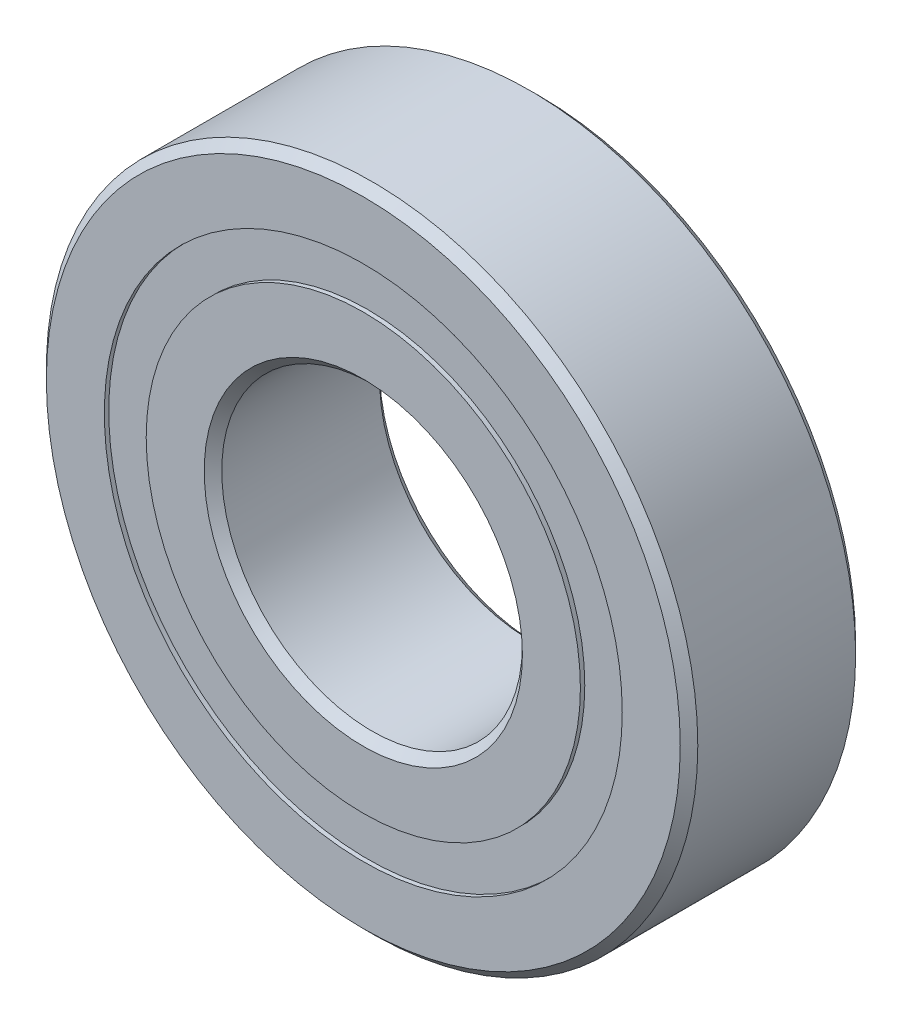
ISO-10303-21;
HEADER;
FILE_DESCRIPTION(('STEP AP214'),'2;1');
FILE_NAME('part.step','',(''),(''),'','','');
FILE_SCHEMA(('AUTOMOTIVE_DESIGN { 1 0 10303 214 1 1 1 1 }'));
ENDSEC;
DATA;
#1=APPLICATION_CONTEXT('core data for automotive mechanical design processes');
#2=APPLICATION_PROTOCOL_DEFINITION('international standard','automotive_design',2000,#1);
#3=PRODUCT_CONTEXT('',#1,'mechanical');
#4=PRODUCT('Part','Part','',(#3));
#5=PRODUCT_RELATED_PRODUCT_CATEGORY('part','',(#4));
#6=PRODUCT_DEFINITION_FORMATION('','',#4);
#7=PRODUCT_DEFINITION_CONTEXT('part definition',#1,'design');
#8=PRODUCT_DEFINITION('design','',#6,#7);
#9=PRODUCT_DEFINITION_SHAPE('','',#8);
#10=(LENGTH_UNIT() NAMED_UNIT(*) SI_UNIT(.MILLI.,.METRE.));
#11=(NAMED_UNIT(*) PLANE_ANGLE_UNIT() SI_UNIT($,.RADIAN.));
#12=(NAMED_UNIT(*) SI_UNIT($,.STERADIAN.) SOLID_ANGLE_UNIT());
#13=UNCERTAINTY_MEASURE_WITH_UNIT(LENGTH_MEASURE(1.E-05),#10,'distance_accuracy_value','');
#14=(GEOMETRIC_REPRESENTATION_CONTEXT(3) GLOBAL_UNCERTAINTY_ASSIGNED_CONTEXT((#13)) GLOBAL_UNIT_ASSIGNED_CONTEXT((#10,
#11,#12)) REPRESENTATION_CONTEXT('',''));
#15=CARTESIAN_POINT('',(0.,0.,0.));
#16=DIRECTION('',(0.,0.,1.));
#17=DIRECTION('',(1.,0.,0.));
#18=AXIS2_PLACEMENT_3D('',#15,#16,#17);
#19=CARTESIAN_POINT('',(0.,16.4070741758242,-5.2784375));
#20=DIRECTION('',(0.,0.,1.));
#21=DIRECTION('',(1.,0.,0.));
#22=AXIS2_PLACEMENT_3D('',#19,#20,#21);
#23=PLANE('',#22);
#24=CARTESIAN_POINT('',(0.,0.,-5.2784375));
#25=DIRECTION('',(0.,0.,1.));
#26=DIRECTION('',(1.,0.,0.));
#27=AXIS2_PLACEMENT_3D('',#24,#25,#26);
#28=CIRCLE('',#27,16.4070741758242);
#29=CARTESIAN_POINT('',(16.4070741758242,0.,-5.2784375));
#30=VERTEX_POINT('',#29);
#31=EDGE_CURVE('E57',#30,#30,#28,.T.);
#32=ORIENTED_EDGE('',*,*,#31,.F.);
#33=EDGE_LOOP('',(#32));
#34=FACE_BOUND('',#33,.T.);
#35=CARTESIAN_POINT('',(0.,0.,-5.2784375));
#36=DIRECTION('',(0.,0.,1.));
#37=DIRECTION('',(1.,0.,0.));
#38=AXIS2_PLACEMENT_3D('',#35,#36,#37);
#39=CIRCLE('',#38,13.7554258241758);
#40=CARTESIAN_POINT('',(13.7554258241758,0.,-5.2784375));
#41=VERTEX_POINT('',#40);
#42=EDGE_CURVE('E11',#41,#41,#39,.T.);
#43=ORIENTED_EDGE('',*,*,#42,.T.);
#44=EDGE_LOOP('',(#43));
#45=FACE_BOUND('',#44,.T.);
#46=ADVANCED_FACE('F43',(#34,#45),#23,.F.);
#47=CARTESIAN_POINT('',(0.,0.,5.55625));
#48=DIRECTION('',(0.,0.,1.));
#49=DIRECTION('',(1.,0.,0.));
#50=AXIS2_PLACEMENT_3D('',#47,#48,#49);
#51=CYLINDRICAL_SURFACE('',#50,13.7554258241758);
#52=ORIENTED_EDGE('',*,*,#42,.F.);
#53=EDGE_LOOP('',(#52));
#54=FACE_BOUND('',#53,.T.);
#55=CARTESIAN_POINT('',(0.,0.,-2.80284955168796));
#56=DIRECTION('',(0.,0.,1.));
#57=DIRECTION('',(1.,0.,0.));
#58=AXIS2_PLACEMENT_3D('',#55,#56,#57);
#59=CIRCLE('',#58,13.7554258241758);
#60=CARTESIAN_POINT('',(13.7554258241758,0.,-2.80284955168796));
#61=VERTEX_POINT('',#60);
#62=EDGE_CURVE('E49',#61,#61,#59,.T.);
#63=ORIENTED_EDGE('',*,*,#62,.T.);
#64=EDGE_LOOP('',(#63));
#65=FACE_BOUND('',#64,.T.);
#66=ADVANCED_FACE('F66',(#54,#65),#51,.F.);
#67=CARTESIAN_POINT('',(0.,16.4070741758242,-2.80284955168796));
#68=DIRECTION('',(0.,0.,-1.));
#69=DIRECTION('',(-1.,0.,0.));
#70=AXIS2_PLACEMENT_3D('',#67,#68,#69);
#71=PLANE('',#70);
#72=ORIENTED_EDGE('',*,*,#62,.F.);
#73=EDGE_LOOP('',(#72));
#74=FACE_BOUND('',#73,.T.);
#75=CARTESIAN_POINT('',(0.,0.,-2.80284955168796));
#76=DIRECTION('',(0.,0.,1.));
#77=DIRECTION('',(1.,0.,0.));
#78=AXIS2_PLACEMENT_3D('',#75,#76,#77);
#79=CIRCLE('',#78,16.4070741758242);
#80=CARTESIAN_POINT('',(16.4070741758242,0.,-2.80284955168796));
#81=VERTEX_POINT('',#80);
#82=EDGE_CURVE('E53',#81,#81,#79,.T.);
#83=ORIENTED_EDGE('',*,*,#82,.T.);
#84=EDGE_LOOP('',(#83));
#85=FACE_BOUND('',#84,.T.);
#86=ADVANCED_FACE('F70',(#74,#85),#71,.F.);
#87=CARTESIAN_POINT('',(0.,0.,5.55625));
#88=DIRECTION('',(0.,0.,1.));
#89=DIRECTION('',(1.,0.,0.));
#90=AXIS2_PLACEMENT_3D('',#87,#88,#89);
#91=CYLINDRICAL_SURFACE('',#90,16.4070741758242);
#92=ORIENTED_EDGE('',*,*,#82,.F.);
#93=EDGE_LOOP('',(#92));
#94=FACE_BOUND('',#93,.T.);
#95=ORIENTED_EDGE('',*,*,#31,.T.);
#96=EDGE_LOOP('',(#95));
#97=FACE_BOUND('',#96,.T.);
#98=ADVANCED_FACE('F63',(#94,#97),#91,.T.);
#99=CLOSED_SHELL('',(#46,#66,#86,#98));
#100=MANIFOLD_SOLID_BREP('B2',#99);
#101=CARTESIAN_POINT('',(0.,16.4070741758242,5.2784375));
#102=DIRECTION('',(0.,0.,-1.));
#103=DIRECTION('',(-1.,0.,0.));
#104=AXIS2_PLACEMENT_3D('',#101,#102,#103);
#105=PLANE('',#104);
#106=CARTESIAN_POINT('',(0.,0.,5.2784375));
#107=DIRECTION('',(0.,0.,1.));
#108=DIRECTION('',(1.,0.,0.));
#109=AXIS2_PLACEMENT_3D('',#106,#107,#108);
#110=CIRCLE('',#109,13.7554258241758);
#111=CARTESIAN_POINT('',(13.7554258241758,0.,5.2784375));
#112=VERTEX_POINT('',#111);
#113=EDGE_CURVE('E42',#112,#112,#110,.T.);
#114=ORIENTED_EDGE('',*,*,#113,.F.);
#115=EDGE_LOOP('',(#114));
#116=FACE_BOUND('',#115,.T.);
#117=CARTESIAN_POINT('',(0.,0.,5.2784375));
#118=DIRECTION('',(0.,0.,1.));
#119=DIRECTION('',(1.,0.,0.));
#120=AXIS2_PLACEMENT_3D('',#117,#118,#119);
#121=CIRCLE('',#120,16.4070741758242);
#122=CARTESIAN_POINT('',(16.4070741758242,0.,5.2784375));
#123=VERTEX_POINT('',#122);
#124=EDGE_CURVE('E124',#123,#123,#121,.T.);
#125=ORIENTED_EDGE('',*,*,#124,.T.);
#126=EDGE_LOOP('',(#125));
#127=FACE_BOUND('',#126,.T.);
#128=ADVANCED_FACE('F110',(#116,#127),#105,.F.);
#129=CARTESIAN_POINT('',(0.,0.,5.55625));
#130=DIRECTION('',(0.,0.,1.));
#131=DIRECTION('',(1.,0.,0.));
#132=AXIS2_PLACEMENT_3D('',#129,#130,#131);
#133=CYLINDRICAL_SURFACE('',#132,13.7554258241758);
#134=CARTESIAN_POINT('',(0.,0.,2.80284955168796));
#135=DIRECTION('',(0.,0.,1.));
#136=DIRECTION('',(1.,0.,0.));
#137=AXIS2_PLACEMENT_3D('',#134,#135,#136);
#138=CIRCLE('',#137,13.7554258241758);
#139=CARTESIAN_POINT('',(13.7554258241758,0.,2.80284955168796));
#140=VERTEX_POINT('',#139);
#141=EDGE_CURVE('E116',#140,#140,#138,.T.);
#142=ORIENTED_EDGE('',*,*,#141,.F.);
#143=EDGE_LOOP('',(#142));
#144=FACE_BOUND('',#143,.T.);
#145=ORIENTED_EDGE('',*,*,#113,.T.);
#146=EDGE_LOOP('',(#145));
#147=FACE_BOUND('',#146,.T.);
#148=ADVANCED_FACE('F139',(#144,#147),#133,.F.);
#149=CARTESIAN_POINT('',(0.,16.4070741758242,2.80284955168796));
#150=DIRECTION('',(0.,0.,1.));
#151=DIRECTION('',(1.,0.,0.));
#152=AXIS2_PLACEMENT_3D('',#149,#150,#151);
#153=PLANE('',#152);
#154=CARTESIAN_POINT('',(0.,0.,2.80284955168796));
#155=DIRECTION('',(0.,0.,1.));
#156=DIRECTION('',(1.,0.,0.));
#157=AXIS2_PLACEMENT_3D('',#154,#155,#156);
#158=CIRCLE('',#157,16.4070741758242);
#159=CARTESIAN_POINT('',(16.4070741758242,0.,2.80284955168796));
#160=VERTEX_POINT('',#159);
#161=EDGE_CURVE('E120',#160,#160,#158,.T.);
#162=ORIENTED_EDGE('',*,*,#161,.F.);
#163=EDGE_LOOP('',(#162));
#164=FACE_BOUND('',#163,.T.);
#165=ORIENTED_EDGE('',*,*,#141,.T.);
#166=EDGE_LOOP('',(#165));
#167=FACE_BOUND('',#166,.T.);
#168=ADVANCED_FACE('F134',(#164,#167),#153,.F.);
#169=CARTESIAN_POINT('',(0.,0.,5.55625));
#170=DIRECTION('',(0.,0.,1.));
#171=DIRECTION('',(1.,0.,0.));
#172=AXIS2_PLACEMENT_3D('',#169,#170,#171);
#173=CYLINDRICAL_SURFACE('',#172,16.4070741758242);
#174=ORIENTED_EDGE('',*,*,#124,.F.);
#175=EDGE_LOOP('',(#174));
#176=FACE_BOUND('',#175,.T.);
#177=ORIENTED_EDGE('',*,*,#161,.T.);
#178=EDGE_LOOP('',(#177));
#179=FACE_BOUND('',#178,.T.);
#180=ADVANCED_FACE('F131',(#176,#179),#173,.T.);
#181=CLOSED_SHELL('',(#128,#148,#168,#180));
#182=MANIFOLD_SOLID_BREP('B6',#181);
#183=CARTESIAN_POINT('',(-8.8645363361357,12.2009875464173,0.));
#184=DIRECTION('',(0.,0.,1.));
#185=DIRECTION('',(-0.587785252292462,0.809016994374955,0.));
#186=AXIS2_PLACEMENT_3D('',#183,#184,#185);
#187=SPHERICAL_SURFACE('',#186,2.80284955168796);
#188=CARTESIAN_POINT('',(-8.8645363361357,12.2009875464173,2.80284955168796));
#189=VERTEX_POINT('',#188);
#190=VERTEX_LOOP('',#189);
#191=FACE_BOUND('',#190,.T.);
#192=ADVANCED_FACE('F177',(#191),#187,.T.);
#193=CLOSED_SHELL('',(#192));
#194=MANIFOLD_SOLID_BREP('B37',#193);
#195=CARTESIAN_POINT('',(-14.3431210863762,4.66036254641734,0.));
#196=DIRECTION('',(0.,0.,1.));
#197=DIRECTION('',(-0.95105651629515,0.309016994374958,0.));
#198=AXIS2_PLACEMENT_3D('',#195,#196,#197);
#199=SPHERICAL_SURFACE('',#198,2.80284955168796);
#200=CARTESIAN_POINT('',(-14.3431210863762,4.66036254641734,2.80284955168796));
#201=VERTEX_POINT('',#200);
#202=VERTEX_LOOP('',#201);
#203=FACE_BOUND('',#202,.T.);
#204=ADVANCED_FACE('F197',(#203),#199,.T.);
#205=CLOSED_SHELL('',(#204));
#206=MANIFOLD_SOLID_BREP('B106',#205);
#207=CARTESIAN_POINT('',(-14.3431210863763,-4.66036254641704,0.));
#208=DIRECTION('',(0.,0.,1.));
#209=DIRECTION('',(-0.951056516295157,-0.309016994374938,0.));
#210=AXIS2_PLACEMENT_3D('',#207,#208,#209);
#211=SPHERICAL_SURFACE('',#210,2.80284955168796);
#212=CARTESIAN_POINT('',(-14.3431210863763,-4.66036254641704,2.80284955168796));
#213=VERTEX_POINT('',#212);
#214=VERTEX_LOOP('',#213);
#215=FACE_BOUND('',#214,.T.);
#216=ADVANCED_FACE('F217',(#215),#211,.T.);
#217=CLOSED_SHELL('',(#216));
#218=MANIFOLD_SOLID_BREP('B173',#217);
#219=CARTESIAN_POINT('',(-8.86453633613597,-12.2009875464171,0.));
#220=DIRECTION('',(0.,0.,1.));
#221=DIRECTION('',(-0.58778525229248,-0.809016994374942,0.));
#222=AXIS2_PLACEMENT_3D('',#219,#220,#221);
#223=SPHERICAL_SURFACE('',#222,2.80284955168796);
#224=CARTESIAN_POINT('',(-8.86453633613597,-12.2009875464171,2.80284955168796));
#225=VERTEX_POINT('',#224);
#226=VERTEX_LOOP('',#225);
#227=FACE_BOUND('',#226,.T.);
#228=ADVANCED_FACE('F237',(#227),#223,.T.);
#229=CLOSED_SHELL('',(#228));
#230=MANIFOLD_SOLID_BREP('B193',#229);
#231=CARTESIAN_POINT('',(-1.05311866879462E-13,-15.08125,0.));
#232=DIRECTION('',(0.,0.,1.));
#233=DIRECTION('',(0.,-1.,0.));
#234=AXIS2_PLACEMENT_3D('',#231,#232,#233);
#235=SPHERICAL_SURFACE('',#234,2.80284955168796);
#236=CARTESIAN_POINT('',(-1.05311866879462E-13,-15.08125,2.80284955168796));
#237=VERTEX_POINT('',#236);
#238=VERTEX_LOOP('',#237);
#239=FACE_BOUND('',#238,.T.);
#240=ADVANCED_FACE('F257',(#239),#235,.T.);
#241=CLOSED_SHELL('',(#240));
#242=MANIFOLD_SOLID_BREP('B213',#241);
#243=CARTESIAN_POINT('',(8.86453633613579,-12.2009875464172,0.));
#244=DIRECTION('',(0.,0.,1.));
#245=DIRECTION('',(0.587785252292469,-0.809016994374951,0.));
#246=AXIS2_PLACEMENT_3D('',#243,#244,#245);
#247=SPHERICAL_SURFACE('',#246,2.80284955168796);
#248=CARTESIAN_POINT('',(8.86453633613579,-12.2009875464172,2.80284955168796));
#249=VERTEX_POINT('',#248);
#250=VERTEX_LOOP('',#249);
#251=FACE_BOUND('',#250,.T.);
#252=ADVANCED_FACE('F277',(#251),#247,.T.);
#253=CLOSED_SHELL('',(#252));
#254=MANIFOLD_SOLID_BREP('B233',#253);
#255=CARTESIAN_POINT('',(14.3431210863763,-4.66036254641724,0.));
#256=DIRECTION('',(0.,0.,1.));
#257=DIRECTION('',(0.951056516295152,-0.309016994374952,0.));
#258=AXIS2_PLACEMENT_3D('',#255,#256,#257);
#259=SPHERICAL_SURFACE('',#258,2.80284955168796);
#260=CARTESIAN_POINT('',(14.3431210863763,-4.66036254641724,2.80284955168796));
#261=VERTEX_POINT('',#260);
#262=VERTEX_LOOP('',#261);
#263=FACE_BOUND('',#262,.T.);
#264=ADVANCED_FACE('F297',(#263),#259,.T.);
#265=CLOSED_SHELL('',(#264));
#266=MANIFOLD_SOLID_BREP('B253',#265);
#267=CARTESIAN_POINT('',(14.3431210863763,4.66036254641714,0.));
#268=DIRECTION('',(0.,0.,1.));
#269=DIRECTION('',(0.951056516295155,0.309016994374945,0.));
#270=AXIS2_PLACEMENT_3D('',#267,#268,#269);
#271=SPHERICAL_SURFACE('',#270,2.80284955168796);
#272=CARTESIAN_POINT('',(14.3431210863763,4.66036254641714,2.80284955168796));
#273=VERTEX_POINT('',#272);
#274=VERTEX_LOOP('',#273);
#275=FACE_BOUND('',#274,.T.);
#276=ADVANCED_FACE('F317',(#275),#271,.T.);
#277=CLOSED_SHELL('',(#276));
#278=MANIFOLD_SOLID_BREP('B273',#277);
#279=CARTESIAN_POINT('',(8.86453633613588,12.2009875464172,0.));
#280=DIRECTION('',(0.,0.,1.));
#281=DIRECTION('',(0.587785252292474,0.809016994374947,0.));
#282=AXIS2_PLACEMENT_3D('',#279,#280,#281);
#283=SPHERICAL_SURFACE('',#282,2.80284955168796);
#284=CARTESIAN_POINT('',(8.86453633613588,12.2009875464172,2.80284955168796));
#285=VERTEX_POINT('',#284);
#286=VERTEX_LOOP('',#285);
#287=FACE_BOUND('',#286,.T.);
#288=ADVANCED_FACE('F337',(#287),#283,.T.);
#289=CLOSED_SHELL('',(#288));
#290=MANIFOLD_SOLID_BREP('B293',#289);
#291=CARTESIAN_POINT('',(0.,15.08125,0.));
#292=DIRECTION('',(0.,0.,1.));
#293=DIRECTION('',(0.,1.,0.));
#294=AXIS2_PLACEMENT_3D('',#291,#292,#293);
#295=SPHERICAL_SURFACE('',#294,2.80284955168796);
#296=CARTESIAN_POINT('',(0.,15.08125,2.80284955168796));
#297=VERTEX_POINT('',#296);
#298=VERTEX_LOOP('',#297);
#299=FACE_BOUND('',#298,.T.);
#300=ADVANCED_FACE('F359',(#299),#295,.T.);
#301=CLOSED_SHELL('',(#300));
#302=MANIFOLD_SOLID_BREP('B313',#301);
#303=CARTESIAN_POINT('',(0.,13.7554258241758,5.55625));
#304=DIRECTION('',(0.,0.,-1.));
#305=DIRECTION('',(-1.,0.,0.));
#306=AXIS2_PLACEMENT_3D('',#303,#304,#305);
#307=PLANE('',#306);
#308=CARTESIAN_POINT('',(0.,0.,5.55625));
#309=DIRECTION('',(0.,0.,1.));
#310=DIRECTION('',(1.,0.,0.));
#311=AXIS2_PLACEMENT_3D('',#308,#309,#310);
#312=CIRCLE('',#311,10.080625);
#313=CARTESIAN_POINT('',(10.080625,0.,5.55625));
#314=VERTEX_POINT('',#313);
#315=EDGE_CURVE('E406',#314,#314,#312,.T.);
#316=ORIENTED_EDGE('',*,*,#315,.F.);
#317=EDGE_LOOP('',(#316));
#318=FACE_BOUND('',#317,.T.);
#319=CARTESIAN_POINT('',(0.,0.,5.55625000000001));
#320=DIRECTION('',(0.,0.,1.));
#321=DIRECTION('',(1.,0.,0.));
#322=AXIS2_PLACEMENT_3D('',#319,#320,#321);
#323=CIRCLE('',#322,13.7554258241758);
#324=CARTESIAN_POINT('',(13.7554258241758,0.,5.55625000000001));
#325=VERTEX_POINT('',#324);
#326=EDGE_CURVE('E358',#325,#325,#323,.T.);
#327=ORIENTED_EDGE('',*,*,#326,.T.);
#328=EDGE_LOOP('',(#327));
#329=FACE_BOUND('',#328,.T.);
#330=ADVANCED_FACE('F378',(#318,#329),#307,.F.);
#331=CARTESIAN_POINT('',(0.,0.,5.55625));
#332=DIRECTION('',(0.,0.,1.));
#333=DIRECTION('',(1.,0.,0.));
#334=AXIS2_PLACEMENT_3D('',#331,#332,#333);
#335=CYLINDRICAL_SURFACE('',#334,13.7554258241758);
#336=ORIENTED_EDGE('',*,*,#326,.F.);
#337=EDGE_LOOP('',(#336));
#338=FACE_BOUND('',#337,.T.);
#339=CARTESIAN_POINT('',(0.,0.,2.46944444444444));
#340=DIRECTION('',(0.,0.,1.));
#341=DIRECTION('',(1.,0.,0.));
#342=AXIS2_PLACEMENT_3D('',#339,#340,#341);
#343=CIRCLE('',#342,13.7554258241758);
#344=CARTESIAN_POINT('',(13.7554258241758,0.,2.46944444444444));
#345=VERTEX_POINT('',#344);
#346=EDGE_CURVE('E384',#345,#345,#343,.T.);
#347=ORIENTED_EDGE('',*,*,#346,.T.);
#348=EDGE_LOOP('',(#347));
#349=FACE_BOUND('',#348,.T.);
#350=ADVANCED_FACE('F413',(#338,#349),#335,.T.);
#351=CARTESIAN_POINT('',(0.,0.,0.));
#352=DIRECTION('',(0.,0.,1.));
#353=DIRECTION('',(1.,0.,0.));
#354=AXIS2_PLACEMENT_3D('',#351,#352,#353);
#355=TOROIDAL_SURFACE('',#354,15.08125,2.80284955168795);
#356=ORIENTED_EDGE('',*,*,#346,.F.);
#357=EDGE_LOOP('',(#356));
#358=FACE_BOUND('',#357,.T.);
#359=CARTESIAN_POINT('',(0.,0.,-2.46944444444445));
#360=DIRECTION('',(0.,0.,1.));
#361=DIRECTION('',(1.,0.,0.));
#362=AXIS2_PLACEMENT_3D('',#359,#360,#361);
#363=CIRCLE('',#362,13.7554258241758);
#364=CARTESIAN_POINT('',(13.7554258241758,0.,-2.46944444444445));
#365=VERTEX_POINT('',#364);
#366=EDGE_CURVE('E388',#365,#365,#363,.T.);
#367=ORIENTED_EDGE('',*,*,#366,.T.);
#368=EDGE_LOOP('',(#367));
#369=FACE_BOUND('',#368,.T.);
#370=ADVANCED_FACE('F417',(#358,#369),#355,.F.);
#371=CARTESIAN_POINT('',(0.,0.,5.55625));
#372=DIRECTION('',(0.,0.,1.));
#373=DIRECTION('',(1.,0.,0.));
#374=AXIS2_PLACEMENT_3D('',#371,#372,#373);
#375=CYLINDRICAL_SURFACE('',#374,13.7554258241758);
#376=ORIENTED_EDGE('',*,*,#366,.F.);
#377=EDGE_LOOP('',(#376));
#378=FACE_BOUND('',#377,.T.);
#379=CARTESIAN_POINT('',(0.,0.,-5.55625));
#380=DIRECTION('',(0.,0.,1.));
#381=DIRECTION('',(1.,0.,0.));
#382=AXIS2_PLACEMENT_3D('',#379,#380,#381);
#383=CIRCLE('',#382,13.7554258241758);
#384=CARTESIAN_POINT('',(13.7554258241758,0.,-5.55625));
#385=VERTEX_POINT('',#384);
#386=EDGE_CURVE('E392',#385,#385,#383,.T.);
#387=ORIENTED_EDGE('',*,*,#386,.T.);
#388=EDGE_LOOP('',(#387));
#389=FACE_BOUND('',#388,.T.);
#390=ADVANCED_FACE('F422',(#378,#389),#375,.T.);
#391=CARTESIAN_POINT('',(0.,10.080625,-5.55625000000001));
#392=DIRECTION('',(0.,0.,1.));
#393=DIRECTION('',(1.,0.,0.));
#394=AXIS2_PLACEMENT_3D('',#391,#392,#393);
#395=PLANE('',#394);
#396=ORIENTED_EDGE('',*,*,#386,.F.);
#397=EDGE_LOOP('',(#396));
#398=FACE_BOUND('',#397,.T.);
#399=CARTESIAN_POINT('',(0.,0.,-5.55625));
#400=DIRECTION('',(0.,0.,1.));
#401=DIRECTION('',(1.,0.,0.));
#402=AXIS2_PLACEMENT_3D('',#399,#400,#401);
#403=CIRCLE('',#402,10.080625);
#404=CARTESIAN_POINT('',(10.080625,0.,-5.55625));
#405=VERTEX_POINT('',#404);
#406=EDGE_CURVE('E397',#405,#405,#403,.T.);
#407=ORIENTED_EDGE('',*,*,#406,.T.);
#408=EDGE_LOOP('',(#407));
#409=FACE_BOUND('',#408,.T.);
#410=ADVANCED_FACE('F428',(#398,#409),#395,.F.);
#411=CARTESIAN_POINT('',(0.,0.,-5.000625));
#412=DIRECTION('',(0.,0.,-1.));
#413=DIRECTION('',(-1.,0.,0.));
#414=AXIS2_PLACEMENT_3D('',#411,#412,#413);
#415=CONICAL_SURFACE('',#414,9.525,0.785398163397447);
#416=ORIENTED_EDGE('',*,*,#406,.F.);
#417=EDGE_LOOP('',(#416));
#418=FACE_BOUND('',#417,.T.);
#419=CARTESIAN_POINT('',(0.,0.,-5.000625));
#420=DIRECTION('',(0.,0.,1.));
#421=DIRECTION('',(1.,0.,0.));
#422=AXIS2_PLACEMENT_3D('',#419,#420,#421);
#423=CIRCLE('',#422,9.525);
#424=CARTESIAN_POINT('',(9.525,0.,-5.000625));
#425=VERTEX_POINT('',#424);
#426=EDGE_CURVE('E400',#425,#425,#423,.T.);
#427=ORIENTED_EDGE('',*,*,#426,.T.);
#428=EDGE_LOOP('',(#427));
#429=FACE_BOUND('',#428,.T.);
#430=ADVANCED_FACE('F432',(#418,#429),#415,.F.);
#431=CARTESIAN_POINT('',(0.,0.,5.55625));
#432=DIRECTION('',(0.,0.,1.));
#433=DIRECTION('',(1.,0.,0.));
#434=AXIS2_PLACEMENT_3D('',#431,#432,#433);
#435=CYLINDRICAL_SURFACE('',#434,9.525);
#436=ORIENTED_EDGE('',*,*,#426,.F.);
#437=EDGE_LOOP('',(#436));
#438=FACE_BOUND('',#437,.T.);
#439=CARTESIAN_POINT('',(0.,0.,5.000625));
#440=DIRECTION('',(0.,0.,1.));
#441=DIRECTION('',(1.,0.,0.));
#442=AXIS2_PLACEMENT_3D('',#439,#440,#441);
#443=CIRCLE('',#442,9.525);
#444=CARTESIAN_POINT('',(9.525,0.,5.000625));
#445=VERTEX_POINT('',#444);
#446=EDGE_CURVE('E403',#445,#445,#443,.T.);
#447=ORIENTED_EDGE('',*,*,#446,.T.);
#448=EDGE_LOOP('',(#447));
#449=FACE_BOUND('',#448,.T.);
#450=ADVANCED_FACE('F436',(#438,#449),#435,.F.);
#451=CARTESIAN_POINT('',(0.,0.,5.55625));
#452=DIRECTION('',(0.,0.,1.));
#453=DIRECTION('',(1.,0.,0.));
#454=AXIS2_PLACEMENT_3D('',#451,#452,#453);
#455=CONICAL_SURFACE('',#454,10.080625,0.785398163397451);
#456=ORIENTED_EDGE('',*,*,#446,.F.);
#457=EDGE_LOOP('',(#456));
#458=FACE_BOUND('',#457,.T.);
#459=ORIENTED_EDGE('',*,*,#315,.T.);
#460=EDGE_LOOP('',(#459));
#461=FACE_BOUND('',#460,.T.);
#462=ADVANCED_FACE('F410',(#458,#461),#455,.F.);
#463=CLOSED_SHELL('',(#330,#350,#370,#390,#410,#430,#450,#462));
#464=MANIFOLD_SOLID_BREP('B333',#463);
#465=CARTESIAN_POINT('',(0.,0.,5.000625));
#466=DIRECTION('',(0.,0.,-1.));
#467=DIRECTION('',(-1.,0.,0.));
#468=AXIS2_PLACEMENT_3D('',#465,#466,#467);
#469=CONICAL_SURFACE('',#468,20.6375,0.785398163397449);
#470=CARTESIAN_POINT('',(0.,0.,5.55625));
#471=DIRECTION('',(0.,0.,1.));
#472=DIRECTION('',(1.,0.,0.));
#473=AXIS2_PLACEMENT_3D('',#470,#471,#472);
#474=CIRCLE('',#473,20.081875);
#475=CARTESIAN_POINT('',(20.081875,0.,5.55625));
#476=VERTEX_POINT('',#475);
#477=EDGE_CURVE('E527',#476,#476,#474,.T.);
#478=ORIENTED_EDGE('',*,*,#477,.F.);
#479=EDGE_LOOP('',(#478));
#480=FACE_BOUND('',#479,.T.);
#481=CARTESIAN_POINT('',(0.,0.,5.000625));
#482=DIRECTION('',(0.,0.,1.));
#483=DIRECTION('',(1.,0.,0.));
#484=AXIS2_PLACEMENT_3D('',#481,#482,#483);
#485=CIRCLE('',#484,20.6375);
#486=CARTESIAN_POINT('',(20.6375,0.,5.000625));
#487=VERTEX_POINT('',#486);
#488=EDGE_CURVE('E377',#487,#487,#485,.T.);
#489=ORIENTED_EDGE('',*,*,#488,.T.);
#490=EDGE_LOOP('',(#489));
#491=FACE_BOUND('',#490,.T.);
#492=ADVANCED_FACE('F499',(#480,#491),#469,.T.);
#493=CARTESIAN_POINT('',(0.,0.,5.55625));
#494=DIRECTION('',(0.,0.,1.));
#495=DIRECTION('',(1.,0.,0.));
#496=AXIS2_PLACEMENT_3D('',#493,#494,#495);
#497=CYLINDRICAL_SURFACE('',#496,20.6375);
#498=ORIENTED_EDGE('',*,*,#488,.F.);
#499=EDGE_LOOP('',(#498));
#500=FACE_BOUND('',#499,.T.);
#501=CARTESIAN_POINT('',(0.,0.,-5.000625));
#502=DIRECTION('',(0.,0.,1.));
#503=DIRECTION('',(1.,0.,0.));
#504=AXIS2_PLACEMENT_3D('',#501,#502,#503);
#505=CIRCLE('',#504,20.6375);
#506=CARTESIAN_POINT('',(20.6375,0.,-5.000625));
#507=VERTEX_POINT('',#506);
#508=EDGE_CURVE('E505',#507,#507,#505,.T.);
#509=ORIENTED_EDGE('',*,*,#508,.T.);
#510=EDGE_LOOP('',(#509));
#511=FACE_BOUND('',#510,.T.);
#512=ADVANCED_FACE('F534',(#500,#511),#497,.T.);
#513=CARTESIAN_POINT('',(0.,0.,-5.55625));
#514=DIRECTION('',(0.,0.,1.));
#515=DIRECTION('',(1.,0.,0.));
#516=AXIS2_PLACEMENT_3D('',#513,#514,#515);
#517=CONICAL_SURFACE('',#516,20.081875,0.785398163397448);
#518=ORIENTED_EDGE('',*,*,#508,.F.);
#519=EDGE_LOOP('',(#518));
#520=FACE_BOUND('',#519,.T.);
#521=CARTESIAN_POINT('',(0.,0.,-5.55625));
#522=DIRECTION('',(0.,0.,1.));
#523=DIRECTION('',(1.,0.,0.));
#524=AXIS2_PLACEMENT_3D('',#521,#522,#523);
#525=CIRCLE('',#524,20.081875);
#526=CARTESIAN_POINT('',(20.081875,0.,-5.55625));
#527=VERTEX_POINT('',#526);
#528=EDGE_CURVE('E509',#527,#527,#525,.T.);
#529=ORIENTED_EDGE('',*,*,#528,.T.);
#530=EDGE_LOOP('',(#529));
#531=FACE_BOUND('',#530,.T.);
#532=ADVANCED_FACE('F538',(#520,#531),#517,.T.);
#533=CARTESIAN_POINT('',(0.,20.081875,-5.55625));
#534=DIRECTION('',(0.,0.,1.));
#535=DIRECTION('',(1.,0.,0.));
#536=AXIS2_PLACEMENT_3D('',#533,#534,#535);
#537=PLANE('',#536);
#538=ORIENTED_EDGE('',*,*,#528,.F.);
#539=EDGE_LOOP('',(#538));
#540=FACE_BOUND('',#539,.T.);
#541=CARTESIAN_POINT('',(0.,0.,-5.55625));
#542=DIRECTION('',(0.,0.,1.));
#543=DIRECTION('',(1.,0.,0.));
#544=AXIS2_PLACEMENT_3D('',#541,#542,#543);
#545=CIRCLE('',#544,16.4070741758242);
#546=CARTESIAN_POINT('',(16.4070741758242,0.,-5.55625));
#547=VERTEX_POINT('',#546);
#548=EDGE_CURVE('E513',#547,#547,#545,.T.);
#549=ORIENTED_EDGE('',*,*,#548,.T.);
#550=EDGE_LOOP('',(#549));
#551=FACE_BOUND('',#550,.T.);
#552=ADVANCED_FACE('F543',(#540,#551),#537,.F.);
#553=CARTESIAN_POINT('',(0.,0.,5.55625));
#554=DIRECTION('',(0.,0.,1.));
#555=DIRECTION('',(1.,0.,0.));
#556=AXIS2_PLACEMENT_3D('',#553,#554,#555);
#557=CYLINDRICAL_SURFACE('',#556,16.4070741758242);
#558=ORIENTED_EDGE('',*,*,#548,.F.);
#559=EDGE_LOOP('',(#558));
#560=FACE_BOUND('',#559,.T.);
#561=CARTESIAN_POINT('',(0.,0.,-2.46944444444444));
#562=DIRECTION('',(0.,0.,1.));
#563=DIRECTION('',(1.,0.,0.));
#564=AXIS2_PLACEMENT_3D('',#561,#562,#563);
#565=CIRCLE('',#564,16.4070741758242);
#566=CARTESIAN_POINT('',(16.4070741758242,0.,-2.46944444444444));
#567=VERTEX_POINT('',#566);
#568=EDGE_CURVE('E518',#567,#567,#565,.T.);
#569=ORIENTED_EDGE('',*,*,#568,.T.);
#570=EDGE_LOOP('',(#569));
#571=FACE_BOUND('',#570,.T.);
#572=ADVANCED_FACE('F549',(#560,#571),#557,.F.);
#573=CARTESIAN_POINT('',(0.,0.,0.));
#574=DIRECTION('',(0.,0.,1.));
#575=DIRECTION('',(1.,0.,0.));
#576=AXIS2_PLACEMENT_3D('',#573,#574,#575);
#577=TOROIDAL_SURFACE('',#576,15.08125,2.80284955168796);
#578=ORIENTED_EDGE('',*,*,#568,.F.);
#579=EDGE_LOOP('',(#578));
#580=FACE_BOUND('',#579,.T.);
#581=CARTESIAN_POINT('',(0.,0.,2.46944444444444));
#582=DIRECTION('',(0.,0.,1.));
#583=DIRECTION('',(1.,0.,0.));
#584=AXIS2_PLACEMENT_3D('',#581,#582,#583);
#585=CIRCLE('',#584,16.4070741758242);
#586=CARTESIAN_POINT('',(16.4070741758242,0.,2.46944444444444));
#587=VERTEX_POINT('',#586);
#588=EDGE_CURVE('E521',#587,#587,#585,.T.);
#589=ORIENTED_EDGE('',*,*,#588,.T.);
#590=EDGE_LOOP('',(#589));
#591=FACE_BOUND('',#590,.T.);
#592=ADVANCED_FACE('F553',(#580,#591),#577,.F.);
#593=CARTESIAN_POINT('',(0.,0.,5.55625));
#594=DIRECTION('',(0.,0.,1.));
#595=DIRECTION('',(1.,0.,0.));
#596=AXIS2_PLACEMENT_3D('',#593,#594,#595);
#597=CYLINDRICAL_SURFACE('',#596,16.4070741758242);
#598=ORIENTED_EDGE('',*,*,#588,.F.);
#599=EDGE_LOOP('',(#598));
#600=FACE_BOUND('',#599,.T.);
#601=CARTESIAN_POINT('',(0.,0.,5.55625));
#602=DIRECTION('',(0.,0.,1.));
#603=DIRECTION('',(1.,0.,0.));
#604=AXIS2_PLACEMENT_3D('',#601,#602,#603);
#605=CIRCLE('',#604,16.4070741758242);
#606=CARTESIAN_POINT('',(16.4070741758242,0.,5.55625));
#607=VERTEX_POINT('',#606);
#608=EDGE_CURVE('E524',#607,#607,#605,.T.);
#609=ORIENTED_EDGE('',*,*,#608,.T.);
#610=EDGE_LOOP('',(#609));
#611=FACE_BOUND('',#610,.T.);
#612=ADVANCED_FACE('F557',(#600,#611),#597,.F.);
#613=CARTESIAN_POINT('',(0.,20.081875,5.55625));
#614=DIRECTION('',(0.,0.,-1.));
#615=DIRECTION('',(-1.,0.,0.));
#616=AXIS2_PLACEMENT_3D('',#613,#614,#615);
#617=PLANE('',#616);
#618=ORIENTED_EDGE('',*,*,#608,.F.);
#619=EDGE_LOOP('',(#618));
#620=FACE_BOUND('',#619,.T.);
#621=ORIENTED_EDGE('',*,*,#477,.T.);
#622=EDGE_LOOP('',(#621));
#623=FACE_BOUND('',#622,.T.);
#624=ADVANCED_FACE('F531',(#620,#623),#617,.F.);
#625=CLOSED_SHELL('',(#492,#512,#532,#552,#572,#592,#612,#624));
#626=MANIFOLD_SOLID_BREP('B353',#625);
#627=ADVANCED_BREP_SHAPE_REPRESENTATION('',(#18,#100,#182,#194,#206,#218,#230,#242,#254,#266,
#278,#290,#302,#464,#626),#14);
#628=SHAPE_DEFINITION_REPRESENTATION(#9,#627);
ENDSEC;
END-ISO-10303-21;
